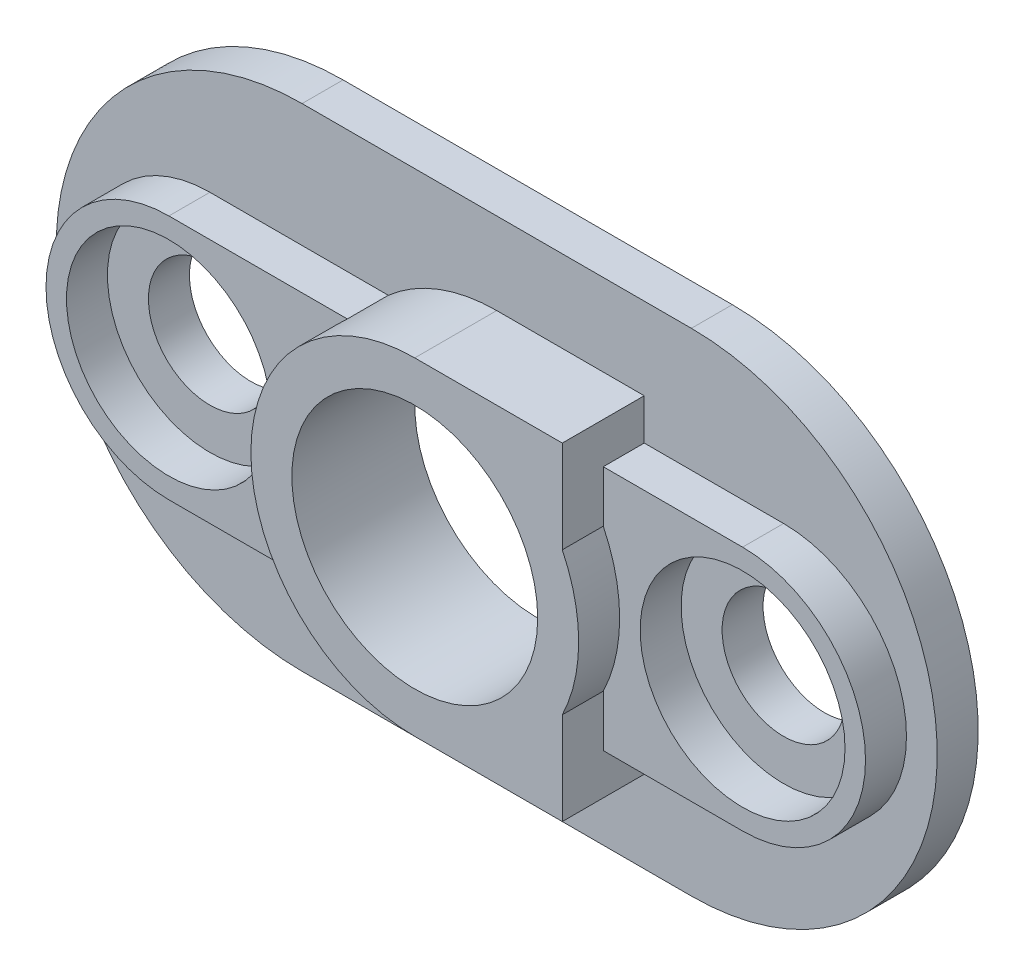
ISO-10303-21;
HEADER;
FILE_DESCRIPTION(('STEP AP214'),'2;1');
FILE_NAME('part.step','',(''),(''),'','','');
FILE_SCHEMA(('AUTOMOTIVE_DESIGN { 1 0 10303 214 1 1 1 1 }'));
ENDSEC;
DATA;
#1=APPLICATION_CONTEXT('core data for automotive mechanical design processes');
#2=APPLICATION_PROTOCOL_DEFINITION('international standard','automotive_design',2000,#1);
#3=PRODUCT_CONTEXT('',#1,'mechanical');
#4=PRODUCT('Part','Part','',(#3));
#5=PRODUCT_RELATED_PRODUCT_CATEGORY('part','',(#4));
#6=PRODUCT_DEFINITION_FORMATION('','',#4);
#7=PRODUCT_DEFINITION_CONTEXT('part definition',#1,'design');
#8=PRODUCT_DEFINITION('design','',#6,#7);
#9=PRODUCT_DEFINITION_SHAPE('','',#8);
#10=(LENGTH_UNIT() NAMED_UNIT(*) SI_UNIT(.MILLI.,.METRE.));
#11=(NAMED_UNIT(*) PLANE_ANGLE_UNIT() SI_UNIT($,.RADIAN.));
#12=(NAMED_UNIT(*) SI_UNIT($,.STERADIAN.) SOLID_ANGLE_UNIT());
#13=UNCERTAINTY_MEASURE_WITH_UNIT(LENGTH_MEASURE(1.E-05),#10,'distance_accuracy_value','');
#14=(GEOMETRIC_REPRESENTATION_CONTEXT(3) GLOBAL_UNCERTAINTY_ASSIGNED_CONTEXT((#13)) GLOBAL_UNIT_ASSIGNED_CONTEXT((#10,
#11,#12)) REPRESENTATION_CONTEXT('',''));
#15=CARTESIAN_POINT('',(0.,0.,0.));
#16=DIRECTION('',(0.,0.,1.));
#17=DIRECTION('',(1.,0.,0.));
#18=AXIS2_PLACEMENT_3D('',#15,#16,#17);
#19=CARTESIAN_POINT('',(-33.549073,21.907042,0.));
#20=DIRECTION('',(0.,0.,1.));
#21=DIRECTION('',(1.,0.,0.));
#22=AXIS2_PLACEMENT_3D('',#19,#20,#21);
#23=CYLINDRICAL_SURFACE('',#22,3.);
#24=CARTESIAN_POINT('',(-33.549073,21.907042,0.));
#25=DIRECTION('',(0.,0.,1.));
#26=DIRECTION('',(1.,0.,0.));
#27=AXIS2_PLACEMENT_3D('',#24,#25,#26);
#28=CIRCLE('',#27,3.);
#29=CARTESIAN_POINT('',(-30.549073,21.907042,0.));
#30=VERTEX_POINT('',#29);
#31=EDGE_CURVE('E302',#30,#30,#28,.T.);
#32=ORIENTED_EDGE('',*,*,#31,.F.);
#33=EDGE_LOOP('',(#32));
#34=FACE_BOUND('',#33,.T.);
#35=CARTESIAN_POINT('',(-33.549073,21.907042,2.));
#36=DIRECTION('',(0.,0.,1.));
#37=DIRECTION('',(1.,0.,0.));
#38=AXIS2_PLACEMENT_3D('',#35,#36,#37);
#39=CIRCLE('',#38,3.);
#40=CARTESIAN_POINT('',(-30.549073,21.907042,2.));
#41=VERTEX_POINT('',#40);
#42=EDGE_CURVE('E37',#41,#41,#39,.F.);
#43=ORIENTED_EDGE('',*,*,#42,.F.);
#44=EDGE_LOOP('',(#43));
#45=FACE_BOUND('',#44,.T.);
#46=ADVANCED_FACE('F33',(#34,#45),#23,.F.);
#47=CARTESIAN_POINT('',(-61.549073,21.907042,0.));
#48=DIRECTION('',(0.,0.,1.));
#49=DIRECTION('',(1.,0.,0.));
#50=AXIS2_PLACEMENT_3D('',#47,#48,#49);
#51=CYLINDRICAL_SURFACE('',#50,3.);
#52=CARTESIAN_POINT('',(-61.549073,21.907042,0.));
#53=DIRECTION('',(0.,0.,1.));
#54=DIRECTION('',(1.,0.,0.));
#55=AXIS2_PLACEMENT_3D('',#52,#53,#54);
#56=CIRCLE('',#55,3.);
#57=CARTESIAN_POINT('',(-58.549073,21.907042,0.));
#58=VERTEX_POINT('',#57);
#59=EDGE_CURVE('E299',#58,#58,#56,.T.);
#60=ORIENTED_EDGE('',*,*,#59,.F.);
#61=EDGE_LOOP('',(#60));
#62=FACE_BOUND('',#61,.T.);
#63=CARTESIAN_POINT('',(-61.549073,21.907042,2.));
#64=DIRECTION('',(0.,0.,1.));
#65=DIRECTION('',(1.,0.,0.));
#66=AXIS2_PLACEMENT_3D('',#63,#64,#65);
#67=CIRCLE('',#66,3.);
#68=CARTESIAN_POINT('',(-58.549073,21.907042,2.));
#69=VERTEX_POINT('',#68);
#70=EDGE_CURVE('E300',#69,#69,#67,.F.);
#71=ORIENTED_EDGE('',*,*,#70,.F.);
#72=EDGE_LOOP('',(#71));
#73=FACE_BOUND('',#72,.T.);
#74=ADVANCED_FACE('F341',(#62,#73),#51,.F.);
#75=CARTESIAN_POINT('',(-57.049073,21.907042,2.));
#76=DIRECTION('',(0.,0.,1.));
#77=DIRECTION('',(1.,0.,0.));
#78=AXIS2_PLACEMENT_3D('',#75,#76,#77);
#79=PLANE('',#78);
#80=CARTESIAN_POINT('',(-57.049073,21.907042,2.));
#81=DIRECTION('',(0.,0.,1.));
#82=DIRECTION('',(1.,0.,0.));
#83=AXIS2_PLACEMENT_3D('',#80,#81,#82);
#84=CIRCLE('',#83,12.);
#85=CARTESIAN_POINT('',(-57.049073,33.907042,2.));
#86=VERTEX_POINT('',#85);
#87=CARTESIAN_POINT('',(-57.049073,9.90704200000002,2.));
#88=VERTEX_POINT('',#87);
#89=EDGE_CURVE('E269',#86,#88,#84,.T.);
#90=ORIENTED_EDGE('',*,*,#89,.T.);
#91=DIRECTION('',(1.,0.,0.));
#92=VECTOR('',#91,1.);
#93=CARTESIAN_POINT('',(-38.049073,9.90704200000002,2.));
#94=LINE('',#93,#92);
#95=CARTESIAN_POINT('',(-38.049073,9.90704200000002,2.));
#96=VERTEX_POINT('',#95);
#97=EDGE_CURVE('E272',#88,#96,#94,.T.);
#98=ORIENTED_EDGE('',*,*,#97,.T.);
#99=CARTESIAN_POINT('',(-38.049073,21.907042,2.));
#100=DIRECTION('',(0.,0.,1.));
#101=DIRECTION('',(1.,0.,0.));
#102=AXIS2_PLACEMENT_3D('',#99,#100,#101);
#103=CIRCLE('',#102,12.);
#104=CARTESIAN_POINT('',(-38.049073,33.907042,2.));
#105=VERTEX_POINT('',#104);
#106=EDGE_CURVE('E274',#96,#105,#103,.T.);
#107=ORIENTED_EDGE('',*,*,#106,.T.);
#108=DIRECTION('',(-1.,0.,0.));
#109=VECTOR('',#108,1.);
#110=CARTESIAN_POINT('',(-57.049073,33.907042,2.));
#111=LINE('',#110,#109);
#112=EDGE_CURVE('E276',#105,#86,#111,.T.);
#113=ORIENTED_EDGE('',*,*,#112,.T.);
#114=EDGE_LOOP('',(#90,#98,#107,#113));
#115=FACE_BOUND('',#114,.T.);
#116=DIRECTION('',(-1.,0.,0.));
#117=VECTOR('',#116,1.);
#118=CARTESIAN_POINT('',(-47.549305,29.907042,2.));
#119=LINE('',#118,#117);
#120=CARTESIAN_POINT('',(-40.349305,29.907042,2.));
#121=VERTEX_POINT('',#120);
#122=CARTESIAN_POINT('',(-47.549305,29.907042,2.));
#123=VERTEX_POINT('',#122);
#124=EDGE_CURVE('E172',#121,#123,#119,.T.);
#125=ORIENTED_EDGE('',*,*,#124,.F.);
#126=DIRECTION('',(0.,1.,0.));
#127=VECTOR('',#126,1.);
#128=CARTESIAN_POINT('',(-40.349305,29.907042,2.));
#129=LINE('',#128,#127);
#130=CARTESIAN_POINT('',(-40.349305,27.907042,2.));
#131=VERTEX_POINT('',#130);
#132=EDGE_CURVE('E162',#131,#121,#129,.T.);
#133=ORIENTED_EDGE('',*,*,#132,.F.);
#134=DIRECTION('',(-1.,0.,0.));
#135=VECTOR('',#134,1.);
#136=CARTESIAN_POINT('',(-61.549073,27.907042,2.));
#137=LINE('',#136,#135);
#138=CARTESIAN_POINT('',(-33.549073,27.907042,2.));
#139=VERTEX_POINT('',#138);
#140=EDGE_CURVE('E236',#139,#131,#137,.T.);
#141=ORIENTED_EDGE('',*,*,#140,.F.);
#142=CARTESIAN_POINT('',(-33.549073,21.907042,2.));
#143=DIRECTION('',(0.,0.,1.));
#144=DIRECTION('',(1.,0.,0.));
#145=AXIS2_PLACEMENT_3D('',#142,#143,#144);
#146=CIRCLE('',#145,6.);
#147=CARTESIAN_POINT('',(-33.549073,15.907042,2.));
#148=VERTEX_POINT('',#147);
#149=EDGE_CURVE('E233',#148,#139,#146,.T.);
#150=ORIENTED_EDGE('',*,*,#149,.F.);
#151=DIRECTION('',(1.,0.,0.));
#152=VECTOR('',#151,1.);
#153=CARTESIAN_POINT('',(-33.549073,15.907042,2.));
#154=LINE('',#153,#152);
#155=CARTESIAN_POINT('',(-40.349305,15.907042,2.));
#156=VERTEX_POINT('',#155);
#157=EDGE_CURVE('E229',#156,#148,#154,.T.);
#158=ORIENTED_EDGE('',*,*,#157,.F.);
#159=DIRECTION('',(0.,1.,0.));
#160=VECTOR('',#159,1.);
#161=CARTESIAN_POINT('',(-40.349305,18.4199228451675,2.));
#162=LINE('',#161,#160);
#163=CARTESIAN_POINT('',(-40.349305,13.907042,2.));
#164=VERTEX_POINT('',#163);
#165=EDGE_CURVE('E194',#164,#156,#162,.T.);
#166=ORIENTED_EDGE('',*,*,#165,.F.);
#167=DIRECTION('',(1.,0.,0.));
#168=VECTOR('',#167,1.);
#169=CARTESIAN_POINT('',(-40.349305,13.907042,2.));
#170=LINE('',#169,#168);
#171=CARTESIAN_POINT('',(-47.549305,13.907042,2.));
#172=VERTEX_POINT('',#171);
#173=EDGE_CURVE('E192',#172,#164,#170,.T.);
#174=ORIENTED_EDGE('',*,*,#173,.F.);
#175=CARTESIAN_POINT('',(-47.549305,21.907042,2.));
#176=DIRECTION('',(0.,0.,1.));
#177=DIRECTION('',(1.,0.,0.));
#178=AXIS2_PLACEMENT_3D('',#175,#176,#177);
#179=CIRCLE('',#178,8.);
#180=CARTESIAN_POINT('',(-52.8408076221292,15.907042,2.));
#181=VERTEX_POINT('',#180);
#182=EDGE_CURVE('E187',#181,#172,#179,.T.);
#183=ORIENTED_EDGE('',*,*,#182,.F.);
#184=CARTESIAN_POINT('',(-61.549073,15.907042,2.));
#185=VERTEX_POINT('',#184);
#186=EDGE_CURVE('E230',#185,#181,#154,.T.);
#187=ORIENTED_EDGE('',*,*,#186,.F.);
#188=CARTESIAN_POINT('',(-61.549073,21.907042,2.));
#189=DIRECTION('',(0.,0.,1.));
#190=DIRECTION('',(1.,0.,0.));
#191=AXIS2_PLACEMENT_3D('',#188,#189,#190);
#192=CIRCLE('',#191,6.);
#193=CARTESIAN_POINT('',(-61.549073,27.907042,2.));
#194=VERTEX_POINT('',#193);
#195=EDGE_CURVE('E226',#194,#185,#192,.T.);
#196=ORIENTED_EDGE('',*,*,#195,.F.);
#197=CARTESIAN_POINT('',(-52.8408076221292,27.907042,2.));
#198=VERTEX_POINT('',#197);
#199=EDGE_CURVE('E235',#198,#194,#137,.T.);
#200=ORIENTED_EDGE('',*,*,#199,.F.);
#201=EDGE_CURVE('E186',#123,#198,#179,.T.);
#202=ORIENTED_EDGE('',*,*,#201,.F.);
#203=EDGE_LOOP('',(#125,#133,#141,#150,#158,#166,#174,#183,#187,#196,#200,#202));
#204=FACE_BOUND('',#203,.T.);
#205=ADVANCED_FACE('F184',(#115,#204),#79,.T.);
#206=CARTESIAN_POINT('',(-33.549073,15.907042,4.));
#207=DIRECTION('',(0.,1.,0.));
#208=DIRECTION('',(0.,0.,1.));
#209=AXIS2_PLACEMENT_3D('',#206,#207,#208);
#210=PLANE('',#209);
#211=DIRECTION('',(0.,0.,-1.));
#212=VECTOR('',#211,1.);
#213=CARTESIAN_POINT('',(-52.8408076221292,15.907042,6.));
#214=LINE('',#213,#212);
#215=CARTESIAN_POINT('',(-52.8408076221292,15.907042,4.));
#216=VERTEX_POINT('',#215);
#217=EDGE_CURVE('E223',#216,#181,#214,.T.);
#218=ORIENTED_EDGE('',*,*,#217,.F.);
#219=DIRECTION('',(1.,0.,0.));
#220=VECTOR('',#219,1.);
#221=CARTESIAN_POINT('',(-33.549073,15.907042,4.));
#222=LINE('',#221,#220);
#223=CARTESIAN_POINT('',(-61.549073,15.907042,4.));
#224=VERTEX_POINT('',#223);
#225=EDGE_CURVE('E242',#224,#216,#222,.T.);
#226=ORIENTED_EDGE('',*,*,#225,.F.);
#227=DIRECTION('',(0.,0.,-1.));
#228=VECTOR('',#227,1.);
#229=CARTESIAN_POINT('',(-61.549073,15.907042,4.));
#230=LINE('',#229,#228);
#231=EDGE_CURVE('E258',#224,#185,#230,.T.);
#232=ORIENTED_EDGE('',*,*,#231,.T.);
#233=ORIENTED_EDGE('',*,*,#186,.T.);
#234=EDGE_LOOP('',(#218,#226,#232,#233));
#235=FACE_BOUND('',#234,.T.);
#236=ADVANCED_FACE('F411',(#235),#210,.F.);
#237=DIRECTION('',(0.,0.,1.));
#238=VECTOR('',#237,1.);
#239=CARTESIAN_POINT('',(-40.349305,15.907042,4.));
#240=LINE('',#239,#238);
#241=CARTESIAN_POINT('',(-40.349305,15.907042,4.));
#242=VERTEX_POINT('',#241);
#243=EDGE_CURVE('E50',#156,#242,#240,.T.);
#244=ORIENTED_EDGE('',*,*,#243,.F.);
#245=ORIENTED_EDGE('',*,*,#157,.T.);
#246=DIRECTION('',(0.,0.,-1.));
#247=VECTOR('',#246,1.);
#248=CARTESIAN_POINT('',(-33.549073,15.907042,4.));
#249=LINE('',#248,#247);
#250=CARTESIAN_POINT('',(-33.549073,15.907042,4.));
#251=VERTEX_POINT('',#250);
#252=EDGE_CURVE('E255',#251,#148,#249,.T.);
#253=ORIENTED_EDGE('',*,*,#252,.F.);
#254=EDGE_CURVE('E241',#242,#251,#222,.T.);
#255=ORIENTED_EDGE('',*,*,#254,.F.);
#256=EDGE_LOOP('',(#244,#245,#253,#255));
#257=FACE_BOUND('',#256,.T.);
#258=ADVANCED_FACE('F390',(#257),#210,.F.);
#259=CARTESIAN_POINT('',(-61.549073,27.907042,4.));
#260=DIRECTION('',(0.,-1.,0.));
#261=DIRECTION('',(0.,0.,-1.));
#262=AXIS2_PLACEMENT_3D('',#259,#260,#261);
#263=PLANE('',#262);
#264=DIRECTION('',(0.,0.,-1.));
#265=VECTOR('',#264,1.);
#266=CARTESIAN_POINT('',(-40.349305,27.907042,4.));
#267=LINE('',#266,#265);
#268=CARTESIAN_POINT('',(-40.349305,27.907042,4.));
#269=VERTEX_POINT('',#268);
#270=EDGE_CURVE('E168',#269,#131,#267,.T.);
#271=ORIENTED_EDGE('',*,*,#270,.F.);
#272=DIRECTION('',(-1.,0.,0.));
#273=VECTOR('',#272,1.);
#274=CARTESIAN_POINT('',(-61.549073,27.907042,4.));
#275=LINE('',#274,#273);
#276=CARTESIAN_POINT('',(-33.549073,27.907042,4.));
#277=VERTEX_POINT('',#276);
#278=EDGE_CURVE('E248',#277,#269,#275,.T.);
#279=ORIENTED_EDGE('',*,*,#278,.F.);
#280=DIRECTION('',(0.,0.,-1.));
#281=VECTOR('',#280,1.);
#282=CARTESIAN_POINT('',(-33.549073,27.907042,4.));
#283=LINE('',#282,#281);
#284=EDGE_CURVE('E58',#277,#139,#283,.T.);
#285=ORIENTED_EDGE('',*,*,#284,.T.);
#286=ORIENTED_EDGE('',*,*,#140,.T.);
#287=EDGE_LOOP('',(#271,#279,#285,#286));
#288=FACE_BOUND('',#287,.T.);
#289=ADVANCED_FACE('F381',(#288),#263,.F.);
#290=DIRECTION('',(0.,0.,-1.));
#291=VECTOR('',#290,1.);
#292=CARTESIAN_POINT('',(-52.8408076221292,27.907042,6.));
#293=LINE('',#292,#291);
#294=CARTESIAN_POINT('',(-52.8408076221292,27.907042,4.));
#295=VERTEX_POINT('',#294);
#296=EDGE_CURVE('E221',#198,#295,#293,.F.);
#297=ORIENTED_EDGE('',*,*,#296,.F.);
#298=ORIENTED_EDGE('',*,*,#199,.T.);
#299=DIRECTION('',(0.,0.,-1.));
#300=VECTOR('',#299,1.);
#301=CARTESIAN_POINT('',(-61.549073,27.907042,4.));
#302=LINE('',#301,#300);
#303=CARTESIAN_POINT('',(-61.549073,27.907042,4.));
#304=VERTEX_POINT('',#303);
#305=EDGE_CURVE('E251',#304,#194,#302,.T.);
#306=ORIENTED_EDGE('',*,*,#305,.F.);
#307=EDGE_CURVE('E247',#295,#304,#275,.T.);
#308=ORIENTED_EDGE('',*,*,#307,.F.);
#309=EDGE_LOOP('',(#297,#298,#306,#308));
#310=FACE_BOUND('',#309,.T.);
#311=ADVANCED_FACE('F422',(#310),#263,.F.);
#312=CARTESIAN_POINT('',(-61.549073,21.907042,4.));
#313=DIRECTION('',(0.,0.,1.));
#314=DIRECTION('',(1.,0.,0.));
#315=AXIS2_PLACEMENT_3D('',#312,#313,#314);
#316=PLANE('',#315);
#317=CARTESIAN_POINT('',(-61.549073,21.907042,4.));
#318=DIRECTION('',(0.,0.,1.));
#319=DIRECTION('',(1.,0.,0.));
#320=AXIS2_PLACEMENT_3D('',#317,#318,#319);
#321=CIRCLE('',#320,5.);
#322=CARTESIAN_POINT('',(-56.549073,21.907042,4.));
#323=VERTEX_POINT('',#322);
#324=EDGE_CURVE('E309',#323,#323,#321,.T.);
#325=ORIENTED_EDGE('',*,*,#324,.F.);
#326=EDGE_LOOP('',(#325));
#327=FACE_BOUND('',#326,.T.);
#328=ORIENTED_EDGE('',*,*,#225,.T.);
#329=CARTESIAN_POINT('',(-47.549305,21.907042,4.));
#330=DIRECTION('',(0.,0.,1.));
#331=DIRECTION('',(1.,0.,0.));
#332=AXIS2_PLACEMENT_3D('',#329,#330,#331);
#333=CIRCLE('',#332,8.);
#334=EDGE_CURVE('E11',#216,#295,#333,.F.);
#335=ORIENTED_EDGE('',*,*,#334,.T.);
#336=ORIENTED_EDGE('',*,*,#307,.T.);
#337=CARTESIAN_POINT('',(-61.549073,21.907042,4.));
#338=DIRECTION('',(0.,0.,1.));
#339=DIRECTION('',(1.,0.,0.));
#340=AXIS2_PLACEMENT_3D('',#337,#338,#339);
#341=CIRCLE('',#340,6.);
#342=EDGE_CURVE('E238',#304,#224,#341,.T.);
#343=ORIENTED_EDGE('',*,*,#342,.T.);
#344=EDGE_LOOP('',(#328,#335,#336,#343));
#345=FACE_BOUND('',#344,.T.);
#346=ADVANCED_FACE('F378',(#327,#345),#316,.T.);
#347=CARTESIAN_POINT('',(-33.549073,21.907042,4.));
#348=DIRECTION('',(0.,0.,1.));
#349=DIRECTION('',(1.,0.,0.));
#350=AXIS2_PLACEMENT_3D('',#347,#348,#349);
#351=CIRCLE('',#350,5.);
#352=CARTESIAN_POINT('',(-28.549073,21.907042,4.));
#353=VERTEX_POINT('',#352);
#354=EDGE_CURVE('E369',#353,#353,#351,.T.);
#355=ORIENTED_EDGE('',*,*,#354,.F.);
#356=EDGE_LOOP('',(#355));
#357=FACE_BOUND('',#356,.T.);
#358=ORIENTED_EDGE('',*,*,#278,.T.);
#359=DIRECTION('',(0.,-1.,0.));
#360=VECTOR('',#359,1.);
#361=CARTESIAN_POINT('',(-40.349305,21.907042,4.));
#362=LINE('',#361,#360);
#363=CARTESIAN_POINT('',(-40.349305,25.3941611548326,4.));
#364=VERTEX_POINT('',#363);
#365=EDGE_CURVE('E42',#269,#364,#362,.T.);
#366=ORIENTED_EDGE('',*,*,#365,.T.);
#367=CARTESIAN_POINT('',(-47.549305,21.907042,4.));
#368=DIRECTION('',(0.,0.,1.));
#369=DIRECTION('',(1.,0.,0.));
#370=AXIS2_PLACEMENT_3D('',#367,#368,#369);
#371=CIRCLE('',#370,8.);
#372=CARTESIAN_POINT('',(-40.349305,18.4199228451675,4.));
#373=VERTEX_POINT('',#372);
#374=EDGE_CURVE('E292',#364,#373,#371,.F.);
#375=ORIENTED_EDGE('',*,*,#374,.T.);
#376=DIRECTION('',(0.,-1.,0.));
#377=VECTOR('',#376,1.);
#378=CARTESIAN_POINT('',(-40.349305,21.907042,4.));
#379=LINE('',#378,#377);
#380=EDGE_CURVE('E290',#373,#242,#379,.T.);
#381=ORIENTED_EDGE('',*,*,#380,.T.);
#382=ORIENTED_EDGE('',*,*,#254,.T.);
#383=CARTESIAN_POINT('',(-33.549073,21.907042,4.));
#384=DIRECTION('',(0.,0.,1.));
#385=DIRECTION('',(1.,0.,0.));
#386=AXIS2_PLACEMENT_3D('',#383,#384,#385);
#387=CIRCLE('',#386,6.);
#388=EDGE_CURVE('E245',#251,#277,#387,.T.);
#389=ORIENTED_EDGE('',*,*,#388,.T.);
#390=EDGE_LOOP('',(#358,#366,#375,#381,#382,#389));
#391=FACE_BOUND('',#390,.T.);
#392=ADVANCED_FACE('F375',(#357,#391),#316,.T.);
#393=CARTESIAN_POINT('',(-57.049073,21.907042,2.));
#394=DIRECTION('',(0.,0.,-1.));
#395=DIRECTION('',(-1.,0.,0.));
#396=AXIS2_PLACEMENT_3D('',#393,#394,#395);
#397=CYLINDRICAL_SURFACE('',#396,12.);
#398=CARTESIAN_POINT('',(-57.049073,21.907042,0.));
#399=DIRECTION('',(0.,0.,1.));
#400=DIRECTION('',(1.,0.,0.));
#401=AXIS2_PLACEMENT_3D('',#398,#399,#400);
#402=CIRCLE('',#401,12.);
#403=CARTESIAN_POINT('',(-57.049073,33.907042,0.));
#404=VERTEX_POINT('',#403);
#405=CARTESIAN_POINT('',(-57.049073,9.90704200000002,0.));
#406=VERTEX_POINT('',#405);
#407=EDGE_CURVE('E260',#404,#406,#402,.T.);
#408=ORIENTED_EDGE('',*,*,#407,.T.);
#409=DIRECTION('',(0.,0.,-1.));
#410=VECTOR('',#409,1.);
#411=CARTESIAN_POINT('',(-57.049073,9.90704200000002,2.));
#412=LINE('',#411,#410);
#413=EDGE_CURVE('E287',#88,#406,#412,.T.);
#414=ORIENTED_EDGE('',*,*,#413,.F.);
#415=ORIENTED_EDGE('',*,*,#89,.F.);
#416=DIRECTION('',(0.,0.,-1.));
#417=VECTOR('',#416,1.);
#418=CARTESIAN_POINT('',(-57.049073,33.907042,2.));
#419=LINE('',#418,#417);
#420=EDGE_CURVE('E278',#86,#404,#419,.T.);
#421=ORIENTED_EDGE('',*,*,#420,.T.);
#422=EDGE_LOOP('',(#408,#414,#415,#421));
#423=FACE_BOUND('',#422,.T.);
#424=ADVANCED_FACE('F35',(#423),#397,.T.);
#425=CARTESIAN_POINT('',(-38.049073,9.90704200000002,2.));
#426=DIRECTION('',(0.,1.,0.));
#427=DIRECTION('',(-1.,0.,0.));
#428=AXIS2_PLACEMENT_3D('',#425,#426,#427);
#429=PLANE('',#428);
#430=DIRECTION('',(1.,0.,0.));
#431=VECTOR('',#430,1.);
#432=CARTESIAN_POINT('',(-38.049073,9.90704200000002,0.));
#433=LINE('',#432,#431);
#434=CARTESIAN_POINT('',(-38.049073,9.90704200000002,0.));
#435=VERTEX_POINT('',#434);
#436=EDGE_CURVE('E263',#406,#435,#433,.T.);
#437=ORIENTED_EDGE('',*,*,#436,.T.);
#438=DIRECTION('',(0.,0.,-1.));
#439=VECTOR('',#438,1.);
#440=CARTESIAN_POINT('',(-38.049073,9.90704200000002,2.));
#441=LINE('',#440,#439);
#442=EDGE_CURVE('E284',#96,#435,#441,.T.);
#443=ORIENTED_EDGE('',*,*,#442,.F.);
#444=ORIENTED_EDGE('',*,*,#97,.F.);
#445=ORIENTED_EDGE('',*,*,#413,.T.);
#446=EDGE_LOOP('',(#437,#443,#444,#445));
#447=FACE_BOUND('',#446,.T.);
#448=ADVANCED_FACE('F450',(#447),#429,.F.);
#449=CARTESIAN_POINT('',(-38.049073,21.907042,2.));
#450=DIRECTION('',(0.,0.,-1.));
#451=DIRECTION('',(-1.,0.,0.));
#452=AXIS2_PLACEMENT_3D('',#449,#450,#451);
#453=CYLINDRICAL_SURFACE('',#452,12.);
#454=CARTESIAN_POINT('',(-38.049073,21.907042,0.));
#455=DIRECTION('',(0.,0.,1.));
#456=DIRECTION('',(1.,0.,0.));
#457=AXIS2_PLACEMENT_3D('',#454,#455,#456);
#458=CIRCLE('',#457,12.);
#459=CARTESIAN_POINT('',(-38.049073,33.907042,0.));
#460=VERTEX_POINT('',#459);
#461=EDGE_CURVE('E265',#435,#460,#458,.T.);
#462=ORIENTED_EDGE('',*,*,#461,.T.);
#463=DIRECTION('',(0.,0.,-1.));
#464=VECTOR('',#463,1.);
#465=CARTESIAN_POINT('',(-38.049073,33.907042,2.));
#466=LINE('',#465,#464);
#467=EDGE_CURVE('E281',#105,#460,#466,.T.);
#468=ORIENTED_EDGE('',*,*,#467,.F.);
#469=ORIENTED_EDGE('',*,*,#106,.F.);
#470=ORIENTED_EDGE('',*,*,#442,.T.);
#471=EDGE_LOOP('',(#462,#468,#469,#470));
#472=FACE_BOUND('',#471,.T.);
#473=ADVANCED_FACE('F447',(#472),#453,.T.);
#474=CARTESIAN_POINT('',(-57.049073,33.907042,2.));
#475=DIRECTION('',(0.,-1.,0.));
#476=DIRECTION('',(1.,0.,0.));
#477=AXIS2_PLACEMENT_3D('',#474,#475,#476);
#478=PLANE('',#477);
#479=DIRECTION('',(-1.,0.,0.));
#480=VECTOR('',#479,1.);
#481=CARTESIAN_POINT('',(-57.049073,33.907042,0.));
#482=LINE('',#481,#480);
#483=EDGE_CURVE('E267',#460,#404,#482,.T.);
#484=ORIENTED_EDGE('',*,*,#483,.T.);
#485=ORIENTED_EDGE('',*,*,#420,.F.);
#486=ORIENTED_EDGE('',*,*,#112,.F.);
#487=ORIENTED_EDGE('',*,*,#467,.T.);
#488=EDGE_LOOP('',(#484,#485,#486,#487));
#489=FACE_BOUND('',#488,.T.);
#490=ADVANCED_FACE('F440',(#489),#478,.F.);
#491=CARTESIAN_POINT('',(-57.049073,21.907042,0.));
#492=DIRECTION('',(0.,0.,1.));
#493=DIRECTION('',(1.,0.,0.));
#494=AXIS2_PLACEMENT_3D('',#491,#492,#493);
#495=PLANE('',#494);
#496=ORIENTED_EDGE('',*,*,#31,.T.);
#497=EDGE_LOOP('',(#496));
#498=FACE_BOUND('',#497,.T.);
#499=ORIENTED_EDGE('',*,*,#59,.T.);
#500=EDGE_LOOP('',(#499));
#501=FACE_BOUND('',#500,.T.);
#502=CARTESIAN_POINT('',(-47.549073,21.907042,0.));
#503=DIRECTION('',(0.,0.,1.));
#504=DIRECTION('',(1.,0.,0.));
#505=AXIS2_PLACEMENT_3D('',#502,#503,#504);
#506=CIRCLE('',#505,5.99999999999999);
#507=CARTESIAN_POINT('',(-41.549073,21.907042,0.));
#508=VERTEX_POINT('',#507);
#509=EDGE_CURVE('E173',#508,#508,#506,.T.);
#510=ORIENTED_EDGE('',*,*,#509,.T.);
#511=EDGE_LOOP('',(#510));
#512=FACE_BOUND('',#511,.T.);
#513=ORIENTED_EDGE('',*,*,#407,.F.);
#514=ORIENTED_EDGE('',*,*,#483,.F.);
#515=ORIENTED_EDGE('',*,*,#461,.F.);
#516=ORIENTED_EDGE('',*,*,#436,.F.);
#517=EDGE_LOOP('',(#513,#514,#515,#516));
#518=FACE_BOUND('',#517,.T.);
#519=ADVANCED_FACE('F321',(#498,#501,#512,#518),#495,.F.);
#520=CARTESIAN_POINT('',(-61.549073,21.907042,4.));
#521=DIRECTION('',(0.,0.,-1.));
#522=DIRECTION('',(-1.,0.,0.));
#523=AXIS2_PLACEMENT_3D('',#520,#521,#522);
#524=CYLINDRICAL_SURFACE('',#523,6.);
#525=ORIENTED_EDGE('',*,*,#195,.T.);
#526=ORIENTED_EDGE('',*,*,#231,.F.);
#527=ORIENTED_EDGE('',*,*,#342,.F.);
#528=ORIENTED_EDGE('',*,*,#305,.T.);
#529=EDGE_LOOP('',(#525,#526,#527,#528));
#530=FACE_BOUND('',#529,.T.);
#531=ADVANCED_FACE('F418',(#530),#524,.T.);
#532=CARTESIAN_POINT('',(-33.549073,21.907042,4.));
#533=DIRECTION('',(0.,0.,-1.));
#534=DIRECTION('',(-1.,0.,0.));
#535=AXIS2_PLACEMENT_3D('',#532,#533,#534);
#536=CYLINDRICAL_SURFACE('',#535,6.);
#537=ORIENTED_EDGE('',*,*,#149,.T.);
#538=ORIENTED_EDGE('',*,*,#284,.F.);
#539=ORIENTED_EDGE('',*,*,#388,.F.);
#540=ORIENTED_EDGE('',*,*,#252,.T.);
#541=EDGE_LOOP('',(#537,#538,#539,#540));
#542=FACE_BOUND('',#541,.T.);
#543=ADVANCED_FACE('F386',(#542),#536,.T.);
#544=CARTESIAN_POINT('',(-40.349305,29.907042,6.));
#545=DIRECTION('',(-1.,0.,0.));
#546=DIRECTION('',(0.,0.,1.));
#547=AXIS2_PLACEMENT_3D('',#544,#545,#546);
#548=PLANE('',#547);
#549=ORIENTED_EDGE('',*,*,#365,.F.);
#550=ORIENTED_EDGE('',*,*,#270,.T.);
#551=ORIENTED_EDGE('',*,*,#132,.T.);
#552=DIRECTION('',(0.,0.,-1.));
#553=VECTOR('',#552,1.);
#554=CARTESIAN_POINT('',(-40.349305,29.907042,6.));
#555=LINE('',#554,#553);
#556=CARTESIAN_POINT('',(-40.349305,29.907042,6.));
#557=VERTEX_POINT('',#556);
#558=EDGE_CURVE('E165',#557,#121,#555,.T.);
#559=ORIENTED_EDGE('',*,*,#558,.F.);
#560=DIRECTION('',(0.,1.,0.));
#561=VECTOR('',#560,1.);
#562=CARTESIAN_POINT('',(-40.349305,29.907042,6.));
#563=LINE('',#562,#561);
#564=CARTESIAN_POINT('',(-40.349305,25.3941611548326,6.));
#565=VERTEX_POINT('',#564);
#566=EDGE_CURVE('E199',#565,#557,#563,.T.);
#567=ORIENTED_EDGE('',*,*,#566,.F.);
#568=DIRECTION('',(0.,0.,-1.));
#569=VECTOR('',#568,1.);
#570=CARTESIAN_POINT('',(-40.349305,25.3941611548326,6.));
#571=LINE('',#570,#569);
#572=EDGE_CURVE('E180',#565,#364,#571,.T.);
#573=ORIENTED_EDGE('',*,*,#572,.T.);
#574=EDGE_LOOP('',(#549,#550,#551,#559,#567,#573));
#575=FACE_BOUND('',#574,.T.);
#576=ADVANCED_FACE('F164',(#575),#548,.F.);
#577=CARTESIAN_POINT('',(-47.549305,21.907042,6.));
#578=DIRECTION('',(0.,0.,-1.));
#579=DIRECTION('',(-1.,0.,0.));
#580=AXIS2_PLACEMENT_3D('',#577,#578,#579);
#581=CYLINDRICAL_SURFACE('',#580,8.);
#582=ORIENTED_EDGE('',*,*,#334,.F.);
#583=ORIENTED_EDGE('',*,*,#217,.T.);
#584=ORIENTED_EDGE('',*,*,#182,.T.);
#585=DIRECTION('',(0.,0.,-1.));
#586=VECTOR('',#585,1.);
#587=CARTESIAN_POINT('',(-47.549305,13.907042,6.));
#588=LINE('',#587,#586);
#589=CARTESIAN_POINT('',(-47.549305,13.907042,6.));
#590=VERTEX_POINT('',#589);
#591=EDGE_CURVE('E214',#590,#172,#588,.T.);
#592=ORIENTED_EDGE('',*,*,#591,.F.);
#593=CARTESIAN_POINT('',(-47.549305,21.907042,6.));
#594=DIRECTION('',(0.,0.,1.));
#595=DIRECTION('',(1.,0.,0.));
#596=AXIS2_PLACEMENT_3D('',#593,#594,#595);
#597=CIRCLE('',#596,8.);
#598=CARTESIAN_POINT('',(-47.549305,29.907042,6.));
#599=VERTEX_POINT('',#598);
#600=EDGE_CURVE('E202',#599,#590,#597,.T.);
#601=ORIENTED_EDGE('',*,*,#600,.F.);
#602=DIRECTION('',(0.,0.,-1.));
#603=VECTOR('',#602,1.);
#604=CARTESIAN_POINT('',(-47.549305,29.907042,6.));
#605=LINE('',#604,#603);
#606=EDGE_CURVE('E181',#599,#123,#605,.T.);
#607=ORIENTED_EDGE('',*,*,#606,.T.);
#608=ORIENTED_EDGE('',*,*,#201,.T.);
#609=ORIENTED_EDGE('',*,*,#296,.T.);
#610=EDGE_LOOP('',(#582,#583,#584,#592,#601,#607,#608,#609));
#611=FACE_BOUND('',#610,.T.);
#612=ADVANCED_FACE('F408',(#611),#581,.T.);
#613=CARTESIAN_POINT('',(-40.349305,18.4199228451675,6.));
#614=DIRECTION('',(-1.,0.,0.));
#615=DIRECTION('',(0.,0.,1.));
#616=AXIS2_PLACEMENT_3D('',#613,#614,#615);
#617=PLANE('',#616);
#618=ORIENTED_EDGE('',*,*,#165,.T.);
#619=ORIENTED_EDGE('',*,*,#243,.T.);
#620=ORIENTED_EDGE('',*,*,#380,.F.);
#621=DIRECTION('',(0.,0.,-1.));
#622=VECTOR('',#621,1.);
#623=CARTESIAN_POINT('',(-40.349305,18.4199228451675,6.));
#624=LINE('',#623,#622);
#625=CARTESIAN_POINT('',(-40.349305,18.4199228451675,6.));
#626=VERTEX_POINT('',#625);
#627=EDGE_CURVE('E208',#626,#373,#624,.T.);
#628=ORIENTED_EDGE('',*,*,#627,.F.);
#629=DIRECTION('',(0.,1.,0.));
#630=VECTOR('',#629,1.);
#631=CARTESIAN_POINT('',(-40.349305,18.4199228451675,6.));
#632=LINE('',#631,#630);
#633=CARTESIAN_POINT('',(-40.349305,13.907042,6.));
#634=VERTEX_POINT('',#633);
#635=EDGE_CURVE('E206',#634,#626,#632,.T.);
#636=ORIENTED_EDGE('',*,*,#635,.F.);
#637=DIRECTION('',(0.,0.,-1.));
#638=VECTOR('',#637,1.);
#639=CARTESIAN_POINT('',(-40.349305,13.907042,6.));
#640=LINE('',#639,#638);
#641=EDGE_CURVE('E211',#634,#164,#640,.T.);
#642=ORIENTED_EDGE('',*,*,#641,.T.);
#643=EDGE_LOOP('',(#618,#619,#620,#628,#636,#642));
#644=FACE_BOUND('',#643,.T.);
#645=ADVANCED_FACE('F392',(#644),#617,.F.);
#646=CARTESIAN_POINT('',(-47.549305,21.907042,6.));
#647=DIRECTION('',(0.,0.,-1.));
#648=DIRECTION('',(-1.,0.,0.));
#649=AXIS2_PLACEMENT_3D('',#646,#647,#648);
#650=CYLINDRICAL_SURFACE('',#649,8.);
#651=ORIENTED_EDGE('',*,*,#374,.F.);
#652=ORIENTED_EDGE('',*,*,#572,.F.);
#653=CARTESIAN_POINT('',(-47.549305,21.907042,6.));
#654=DIRECTION('',(0.,0.,1.));
#655=DIRECTION('',(1.,0.,0.));
#656=AXIS2_PLACEMENT_3D('',#653,#654,#655);
#657=CIRCLE('',#656,8.);
#658=EDGE_CURVE('E196',#626,#565,#657,.T.);
#659=ORIENTED_EDGE('',*,*,#658,.F.);
#660=ORIENTED_EDGE('',*,*,#627,.T.);
#661=EDGE_LOOP('',(#651,#652,#659,#660));
#662=FACE_BOUND('',#661,.T.);
#663=ADVANCED_FACE('F396',(#662),#650,.T.);
#664=CARTESIAN_POINT('',(-47.549305,29.907042,6.));
#665=DIRECTION('',(0.,-1.,0.));
#666=DIRECTION('',(1.,0.,0.));
#667=AXIS2_PLACEMENT_3D('',#664,#665,#666);
#668=PLANE('',#667);
#669=ORIENTED_EDGE('',*,*,#124,.T.);
#670=ORIENTED_EDGE('',*,*,#606,.F.);
#671=DIRECTION('',(-1.,0.,0.));
#672=VECTOR('',#671,1.);
#673=CARTESIAN_POINT('',(-47.549305,29.907042,6.));
#674=LINE('',#673,#672);
#675=EDGE_CURVE('E179',#557,#599,#674,.T.);
#676=ORIENTED_EDGE('',*,*,#675,.F.);
#677=ORIENTED_EDGE('',*,*,#558,.T.);
#678=EDGE_LOOP('',(#669,#670,#676,#677));
#679=FACE_BOUND('',#678,.T.);
#680=ADVANCED_FACE('F176',(#679),#668,.F.);
#681=CARTESIAN_POINT('',(-40.349305,13.907042,6.));
#682=DIRECTION('',(0.,1.,0.));
#683=DIRECTION('',(0.,0.,1.));
#684=AXIS2_PLACEMENT_3D('',#681,#682,#683);
#685=PLANE('',#684);
#686=ORIENTED_EDGE('',*,*,#173,.T.);
#687=ORIENTED_EDGE('',*,*,#641,.F.);
#688=DIRECTION('',(1.,0.,0.));
#689=VECTOR('',#688,1.);
#690=CARTESIAN_POINT('',(-40.349305,13.907042,6.));
#691=LINE('',#690,#689);
#692=EDGE_CURVE('E204',#590,#634,#691,.T.);
#693=ORIENTED_EDGE('',*,*,#692,.F.);
#694=ORIENTED_EDGE('',*,*,#591,.T.);
#695=EDGE_LOOP('',(#686,#687,#693,#694));
#696=FACE_BOUND('',#695,.T.);
#697=ADVANCED_FACE('F336',(#696),#685,.F.);
#698=CARTESIAN_POINT('',(-47.549305,21.907042,6.));
#699=DIRECTION('',(0.,0.,1.));
#700=DIRECTION('',(1.,0.,0.));
#701=AXIS2_PLACEMENT_3D('',#698,#699,#700);
#702=PLANE('',#701);
#703=CARTESIAN_POINT('',(-47.549073,21.907042,6.));
#704=DIRECTION('',(0.,0.,1.));
#705=DIRECTION('',(1.,0.,0.));
#706=AXIS2_PLACEMENT_3D('',#703,#704,#705);
#707=CIRCLE('',#706,5.99999999999999);
#708=CARTESIAN_POINT('',(-41.549073,21.907042,6.));
#709=VERTEX_POINT('',#708);
#710=EDGE_CURVE('E297',#709,#709,#707,.T.);
#711=ORIENTED_EDGE('',*,*,#710,.F.);
#712=EDGE_LOOP('',(#711));
#713=FACE_BOUND('',#712,.T.);
#714=ORIENTED_EDGE('',*,*,#658,.T.);
#715=ORIENTED_EDGE('',*,*,#566,.T.);
#716=ORIENTED_EDGE('',*,*,#675,.T.);
#717=ORIENTED_EDGE('',*,*,#600,.T.);
#718=ORIENTED_EDGE('',*,*,#692,.T.);
#719=ORIENTED_EDGE('',*,*,#635,.T.);
#720=EDGE_LOOP('',(#714,#715,#716,#717,#718,#719));
#721=FACE_BOUND('',#720,.T.);
#722=ADVANCED_FACE('F327',(#713,#721),#702,.T.);
#723=CARTESIAN_POINT('',(-47.549073,21.907042,-0.999999999999999));
#724=DIRECTION('',(0.,0.,1.));
#725=DIRECTION('',(1.,0.,0.));
#726=AXIS2_PLACEMENT_3D('',#723,#724,#725);
#727=CYLINDRICAL_SURFACE('',#726,5.99999999999999);
#728=ORIENTED_EDGE('',*,*,#710,.T.);
#729=EDGE_LOOP('',(#728));
#730=FACE_BOUND('',#729,.T.);
#731=ORIENTED_EDGE('',*,*,#509,.F.);
#732=EDGE_LOOP('',(#731));
#733=FACE_BOUND('',#732,.T.);
#734=ADVANCED_FACE('F324',(#730,#733),#727,.F.);
#735=CARTESIAN_POINT('',(-61.549073,21.907042,2.));
#736=DIRECTION('',(0.,0.,1.));
#737=DIRECTION('',(1.,0.,0.));
#738=AXIS2_PLACEMENT_3D('',#735,#736,#737);
#739=PLANE('',#738);
#740=CARTESIAN_POINT('',(-61.549073,21.907042,2.));
#741=DIRECTION('',(0.,0.,1.));
#742=DIRECTION('',(1.,0.,0.));
#743=AXIS2_PLACEMENT_3D('',#740,#741,#742);
#744=CIRCLE('',#743,5.);
#745=CARTESIAN_POINT('',(-56.549073,21.907042,2.));
#746=VERTEX_POINT('',#745);
#747=EDGE_CURVE('E303',#746,#746,#744,.T.);
#748=ORIENTED_EDGE('',*,*,#747,.T.);
#749=EDGE_LOOP('',(#748));
#750=FACE_BOUND('',#749,.T.);
#751=ORIENTED_EDGE('',*,*,#70,.T.);
#752=EDGE_LOOP('',(#751));
#753=FACE_BOUND('',#752,.T.);
#754=ADVANCED_FACE('F326',(#750,#753),#739,.T.);
#755=CARTESIAN_POINT('',(-61.549073,21.907042,2.));
#756=DIRECTION('',(0.,0.,1.));
#757=DIRECTION('',(1.,0.,0.));
#758=AXIS2_PLACEMENT_3D('',#755,#756,#757);
#759=CYLINDRICAL_SURFACE('',#758,5.);
#760=ORIENTED_EDGE('',*,*,#747,.F.);
#761=EDGE_LOOP('',(#760));
#762=FACE_BOUND('',#761,.T.);
#763=ORIENTED_EDGE('',*,*,#324,.T.);
#764=EDGE_LOOP('',(#763));
#765=FACE_BOUND('',#764,.T.);
#766=ADVANCED_FACE('F334',(#762,#765),#759,.F.);
#767=CARTESIAN_POINT('',(-33.549073,21.907042,2.));
#768=DIRECTION('',(0.,0.,1.));
#769=DIRECTION('',(1.,0.,0.));
#770=AXIS2_PLACEMENT_3D('',#767,#768,#769);
#771=PLANE('',#770);
#772=CARTESIAN_POINT('',(-33.549073,21.907042,2.));
#773=DIRECTION('',(0.,0.,1.));
#774=DIRECTION('',(1.,0.,0.));
#775=AXIS2_PLACEMENT_3D('',#772,#773,#774);
#776=CIRCLE('',#775,5.);
#777=CARTESIAN_POINT('',(-28.549073,21.907042,2.));
#778=VERTEX_POINT('',#777);
#779=EDGE_CURVE('E366',#778,#778,#776,.T.);
#780=ORIENTED_EDGE('',*,*,#779,.T.);
#781=EDGE_LOOP('',(#780));
#782=FACE_BOUND('',#781,.T.);
#783=ORIENTED_EDGE('',*,*,#42,.T.);
#784=EDGE_LOOP('',(#783));
#785=FACE_BOUND('',#784,.T.);
#786=ADVANCED_FACE('F352',(#782,#785),#771,.T.);
#787=CARTESIAN_POINT('',(-33.549073,21.907042,2.));
#788=DIRECTION('',(0.,0.,1.));
#789=DIRECTION('',(1.,0.,0.));
#790=AXIS2_PLACEMENT_3D('',#787,#788,#789);
#791=CYLINDRICAL_SURFACE('',#790,5.);
#792=ORIENTED_EDGE('',*,*,#779,.F.);
#793=EDGE_LOOP('',(#792));
#794=FACE_BOUND('',#793,.T.);
#795=ORIENTED_EDGE('',*,*,#354,.T.);
#796=EDGE_LOOP('',(#795));
#797=FACE_BOUND('',#796,.T.);
#798=ADVANCED_FACE('F355',(#794,#797),#791,.F.);
#799=CLOSED_SHELL('',(#46,#74,#205,#236,#258,#289,#311,#346,#392,#424,#448,#473,#490,#519,#531,
#543,#576,#612,#645,#663,#680,#697,#722,#734,#754,#766,#786,#798));
#800=MANIFOLD_SOLID_BREP('B2',#799);
#801=ADVANCED_BREP_SHAPE_REPRESENTATION('',(#18,#800),#14);
#802=SHAPE_DEFINITION_REPRESENTATION(#9,#801);
ENDSEC;
END-ISO-10303-21;
